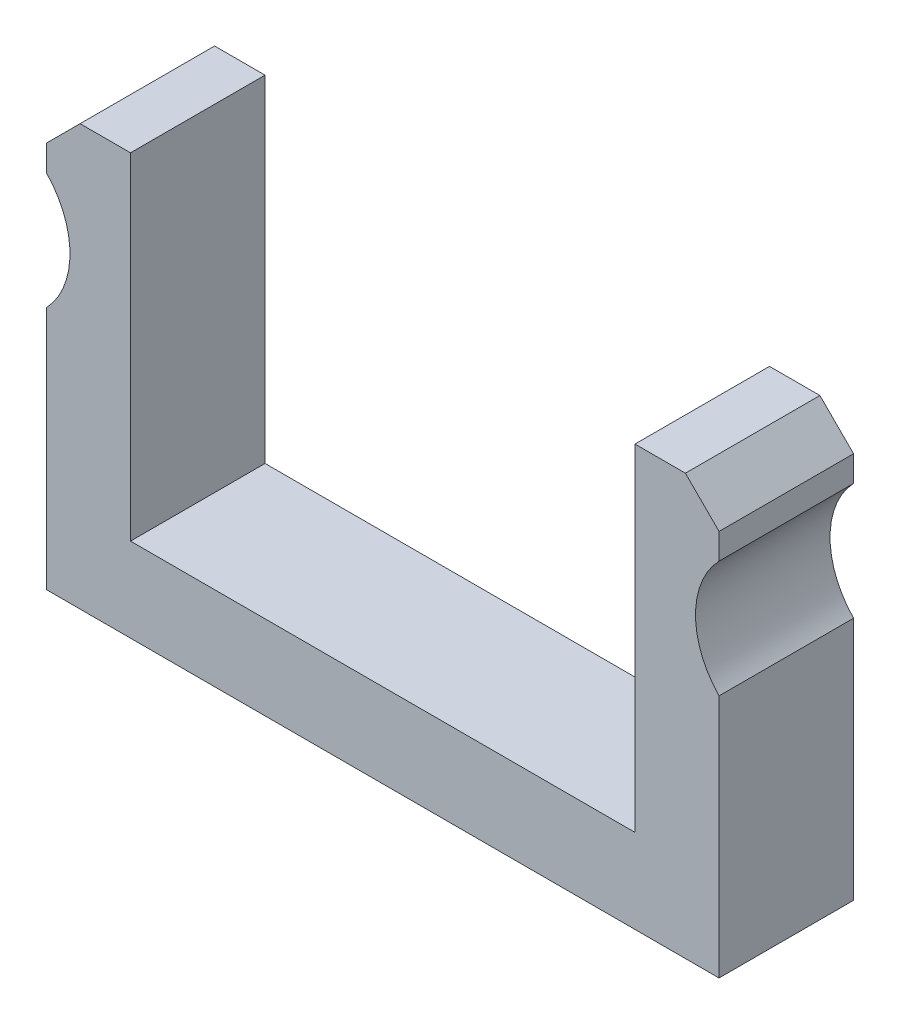
ISO-10303-21;
HEADER;
FILE_DESCRIPTION(('STEP AP214'),'2;1');
FILE_NAME('part.step','',(''),(''),'','','');
FILE_SCHEMA(('AUTOMOTIVE_DESIGN { 1 0 10303 214 1 1 1 1 }'));
ENDSEC;
DATA;
#1=APPLICATION_CONTEXT('core data for automotive mechanical design processes');
#2=APPLICATION_PROTOCOL_DEFINITION('international standard','automotive_design',2000,#1);
#3=PRODUCT_CONTEXT('',#1,'mechanical');
#4=PRODUCT('Part','Part','',(#3));
#5=PRODUCT_RELATED_PRODUCT_CATEGORY('part','',(#4));
#6=PRODUCT_DEFINITION_FORMATION('','',#4);
#7=PRODUCT_DEFINITION_CONTEXT('part definition',#1,'design');
#8=PRODUCT_DEFINITION('design','',#6,#7);
#9=PRODUCT_DEFINITION_SHAPE('','',#8);
#10=(LENGTH_UNIT() NAMED_UNIT(*) SI_UNIT(.MILLI.,.METRE.));
#11=(NAMED_UNIT(*) PLANE_ANGLE_UNIT() SI_UNIT($,.RADIAN.));
#12=(NAMED_UNIT(*) SI_UNIT($,.STERADIAN.) SOLID_ANGLE_UNIT());
#13=UNCERTAINTY_MEASURE_WITH_UNIT(LENGTH_MEASURE(1.E-05),#10,'distance_accuracy_value','');
#14=(GEOMETRIC_REPRESENTATION_CONTEXT(3) GLOBAL_UNCERTAINTY_ASSIGNED_CONTEXT((#13)) GLOBAL_UNIT_ASSIGNED_CONTEXT((#10,
#11,#12)) REPRESENTATION_CONTEXT('',''));
#15=CARTESIAN_POINT('',(0.,0.,0.));
#16=DIRECTION('',(0.,0.,1.));
#17=DIRECTION('',(1.,0.,0.));
#18=AXIS2_PLACEMENT_3D('',#15,#16,#17);
#19=CARTESIAN_POINT('',(16.7574956918045,-19.3746351202378,10.16));
#20=DIRECTION('',(-1.,0.,0.));
#21=DIRECTION('',(0.,0.,1.));
#22=AXIS2_PLACEMENT_3D('',#19,#20,#21);
#23=PLANE('',#22);
#24=DIRECTION('',(0.,1.,0.));
#25=VECTOR('',#24,1.);
#26=CARTESIAN_POINT('',(16.7574956918045,-19.3746351202378,0.));
#27=LINE('',#26,#25);
#28=CARTESIAN_POINT('',(16.7574956918045,-19.3746351202378,0.));
#29=VERTEX_POINT('',#28);
#30=CARTESIAN_POINT('',(16.7574956918045,-0.921370419753809,0.));
#31=VERTEX_POINT('',#30);
#32=EDGE_CURVE('E180',#29,#31,#27,.T.);
#33=ORIENTED_EDGE('',*,*,#32,.T.);
#34=DIRECTION('',(0.,0.,1.));
#35=VECTOR('',#34,1.);
#36=CARTESIAN_POINT('',(16.7574956918045,-0.921370419753809,-15.24));
#37=LINE('',#36,#35);
#38=CARTESIAN_POINT('',(16.7574956918045,-0.921370419753809,10.16));
#39=VERTEX_POINT('',#38);
#40=EDGE_CURVE('E143',#31,#39,#37,.T.);
#41=ORIENTED_EDGE('',*,*,#40,.T.);
#42=DIRECTION('',(0.,1.,0.));
#43=VECTOR('',#42,1.);
#44=CARTESIAN_POINT('',(16.7574956918045,-19.3746351202378,10.16));
#45=LINE('',#44,#43);
#46=CARTESIAN_POINT('',(16.7574956918045,-19.3746351202378,10.16));
#47=VERTEX_POINT('',#46);
#48=EDGE_CURVE('E152',#47,#39,#45,.T.);
#49=ORIENTED_EDGE('',*,*,#48,.F.);
#50=DIRECTION('',(0.,0.,-1.));
#51=VECTOR('',#50,1.);
#52=CARTESIAN_POINT('',(16.7574956918045,-19.3746351202378,10.16));
#53=LINE('',#52,#51);
#54=EDGE_CURVE('E205',#47,#29,#53,.T.);
#55=ORIENTED_EDGE('',*,*,#54,.T.);
#56=EDGE_LOOP('',(#33,#41,#49,#55));
#57=FACE_BOUND('',#56,.T.);
#58=ADVANCED_FACE('F32',(#57),#23,.F.);
#59=CARTESIAN_POINT('',(-34.0425043081955,-19.3746351202378,10.16));
#60=DIRECTION('',(1.,0.,0.));
#61=DIRECTION('',(0.,0.,-1.));
#62=AXIS2_PLACEMENT_3D('',#59,#60,#61);
#63=PLANE('',#62);
#64=DIRECTION('',(0.,-1.,0.));
#65=VECTOR('',#64,1.);
#66=CARTESIAN_POINT('',(-34.0425043081955,-19.3746351202378,10.16));
#67=LINE('',#66,#65);
#68=CARTESIAN_POINT('',(-34.0425043081955,9.83536487976214,10.16));
#69=VERTEX_POINT('',#68);
#70=CARTESIAN_POINT('',(-34.0425043081955,7.89210017927812,10.16));
#71=VERTEX_POINT('',#70);
#72=EDGE_CURVE('E160',#69,#71,#67,.T.);
#73=ORIENTED_EDGE('',*,*,#72,.F.);
#74=DIRECTION('',(0.,0.,-1.));
#75=VECTOR('',#74,1.);
#76=CARTESIAN_POINT('',(-34.0425043081955,9.83536487976214,10.16));
#77=LINE('',#76,#75);
#78=CARTESIAN_POINT('',(-34.0425043081955,9.83536487976214,0.));
#79=VERTEX_POINT('',#78);
#80=EDGE_CURVE('E222',#69,#79,#77,.T.);
#81=ORIENTED_EDGE('',*,*,#80,.T.);
#82=DIRECTION('',(0.,-1.,0.));
#83=VECTOR('',#82,1.);
#84=CARTESIAN_POINT('',(-34.0425043081955,-19.3746351202378,0.));
#85=LINE('',#84,#83);
#86=CARTESIAN_POINT('',(-34.0425043081955,7.89210017927812,0.));
#87=VERTEX_POINT('',#86);
#88=EDGE_CURVE('E174',#79,#87,#85,.T.);
#89=ORIENTED_EDGE('',*,*,#88,.T.);
#90=DIRECTION('',(0.,0.,1.));
#91=VECTOR('',#90,1.);
#92=CARTESIAN_POINT('',(-34.0425043081955,7.89210017927812,-15.24));
#93=LINE('',#92,#91);
#94=EDGE_CURVE('E243',#87,#71,#93,.T.);
#95=ORIENTED_EDGE('',*,*,#94,.T.);
#96=EDGE_LOOP('',(#73,#81,#89,#95));
#97=FACE_BOUND('',#96,.T.);
#98=ADVANCED_FACE('F228',(#97),#63,.F.);
#99=CARTESIAN_POINT('',(-34.0425043081955,-0.921370419753809,10.16));
#100=VERTEX_POINT('',#99);
#101=CARTESIAN_POINT('',(-34.0425043081955,-19.3746351202378,10.16));
#102=VERTEX_POINT('',#101);
#103=EDGE_CURVE('E193',#100,#102,#67,.T.);
#104=ORIENTED_EDGE('',*,*,#103,.F.);
#105=DIRECTION('',(0.,0.,1.));
#106=VECTOR('',#105,1.);
#107=CARTESIAN_POINT('',(-34.0425043081955,-0.921370419753809,-15.24));
#108=LINE('',#107,#106);
#109=CARTESIAN_POINT('',(-34.0425043081955,-0.921370419753809,0.));
#110=VERTEX_POINT('',#109);
#111=EDGE_CURVE('E241',#100,#110,#108,.F.);
#112=ORIENTED_EDGE('',*,*,#111,.T.);
#113=CARTESIAN_POINT('',(-34.0425043081955,-19.3746351202378,0.));
#114=VERTEX_POINT('',#113);
#115=EDGE_CURVE('E177',#110,#114,#85,.T.);
#116=ORIENTED_EDGE('',*,*,#115,.T.);
#117=DIRECTION('',(0.,0.,-1.));
#118=VECTOR('',#117,1.);
#119=CARTESIAN_POINT('',(-34.0425043081955,-19.3746351202378,10.16));
#120=LINE('',#119,#118);
#121=EDGE_CURVE('E208',#102,#114,#120,.T.);
#122=ORIENTED_EDGE('',*,*,#121,.F.);
#123=EDGE_LOOP('',(#104,#112,#116,#122));
#124=FACE_BOUND('',#123,.T.);
#125=ADVANCED_FACE('F246',(#124),#63,.F.);
#126=CARTESIAN_POINT('',(-34.0425043081955,-19.3746351202378,10.16));
#127=DIRECTION('',(0.,1.,0.));
#128=DIRECTION('',(0.,0.,1.));
#129=AXIS2_PLACEMENT_3D('',#126,#127,#128);
#130=PLANE('',#129);
#131=DIRECTION('',(1.,0.,0.));
#132=VECTOR('',#131,1.);
#133=CARTESIAN_POINT('',(-34.0425043081955,-19.3746351202378,0.));
#134=LINE('',#133,#132);
#135=EDGE_CURVE('E176',#114,#29,#134,.T.);
#136=ORIENTED_EDGE('',*,*,#135,.T.);
#137=ORIENTED_EDGE('',*,*,#54,.F.);
#138=DIRECTION('',(1.,0.,0.));
#139=VECTOR('',#138,1.);
#140=CARTESIAN_POINT('',(-34.0425043081955,-19.3746351202378,10.16));
#141=LINE('',#140,#139);
#142=EDGE_CURVE('E157',#102,#47,#141,.T.);
#143=ORIENTED_EDGE('',*,*,#142,.F.);
#144=ORIENTED_EDGE('',*,*,#121,.T.);
#145=EDGE_LOOP('',(#136,#137,#143,#144));
#146=FACE_BOUND('',#145,.T.);
#147=ADVANCED_FACE('F256',(#146),#130,.F.);
#148=CARTESIAN_POINT('',(16.7574956918045,7.89210017927812,0.));
#149=VERTEX_POINT('',#148);
#150=CARTESIAN_POINT('',(16.7574956918045,9.83536487976212,0.));
#151=VERTEX_POINT('',#150);
#152=EDGE_CURVE('E179',#149,#151,#27,.T.);
#153=ORIENTED_EDGE('',*,*,#152,.T.);
#154=DIRECTION('',(0.,0.,1.));
#155=VECTOR('',#154,1.);
#156=CARTESIAN_POINT('',(16.7574956918045,9.83536487976212,10.16));
#157=LINE('',#156,#155);
#158=CARTESIAN_POINT('',(16.7574956918045,9.83536487976213,10.16));
#159=VERTEX_POINT('',#158);
#160=EDGE_CURVE('E156',#151,#159,#157,.T.);
#161=ORIENTED_EDGE('',*,*,#160,.T.);
#162=CARTESIAN_POINT('',(16.7574956918045,7.89210017927812,10.16));
#163=VERTEX_POINT('',#162);
#164=EDGE_CURVE('E149',#163,#159,#45,.T.);
#165=ORIENTED_EDGE('',*,*,#164,.F.);
#166=DIRECTION('',(0.,0.,1.));
#167=VECTOR('',#166,1.);
#168=CARTESIAN_POINT('',(16.7574956918045,7.89210017927812,-15.24));
#169=LINE('',#168,#167);
#170=EDGE_CURVE('E132',#163,#149,#169,.F.);
#171=ORIENTED_EDGE('',*,*,#170,.T.);
#172=EDGE_LOOP('',(#153,#161,#165,#171));
#173=FACE_BOUND('',#172,.T.);
#174=ADVANCED_FACE('F154',(#173),#23,.F.);
#175=CARTESIAN_POINT('',(16.7574956918045,12.3753648797622,10.16));
#176=DIRECTION('',(0.,-1.,0.));
#177=DIRECTION('',(0.,0.,-1.));
#178=AXIS2_PLACEMENT_3D('',#175,#176,#177);
#179=PLANE('',#178);
#180=DIRECTION('',(-1.,0.,0.));
#181=VECTOR('',#180,1.);
#182=CARTESIAN_POINT('',(16.7574956918045,12.3753648797622,10.16));
#183=LINE('',#182,#181);
#184=CARTESIAN_POINT('',(14.2174956918045,12.3753648797622,10.16));
#185=VERTEX_POINT('',#184);
#186=CARTESIAN_POINT('',(10.4074956918045,12.3753648797622,10.16));
#187=VERTEX_POINT('',#186);
#188=EDGE_CURVE('E159',#185,#187,#183,.T.);
#189=ORIENTED_EDGE('',*,*,#188,.F.);
#190=DIRECTION('',(0.,0.,-1.));
#191=VECTOR('',#190,1.);
#192=CARTESIAN_POINT('',(14.2174956918045,12.3753648797622,10.16));
#193=LINE('',#192,#191);
#194=CARTESIAN_POINT('',(14.2174956918045,12.3753648797622,0.));
#195=VERTEX_POINT('',#194);
#196=EDGE_CURVE('E214',#185,#195,#193,.T.);
#197=ORIENTED_EDGE('',*,*,#196,.T.);
#198=DIRECTION('',(-1.,0.,0.));
#199=VECTOR('',#198,1.);
#200=CARTESIAN_POINT('',(16.7574956918045,12.3753648797622,0.));
#201=LINE('',#200,#199);
#202=CARTESIAN_POINT('',(10.4074956918045,12.3753648797622,0.));
#203=VERTEX_POINT('',#202);
#204=EDGE_CURVE('E183',#195,#203,#201,.T.);
#205=ORIENTED_EDGE('',*,*,#204,.T.);
#206=DIRECTION('',(0.,0.,-1.));
#207=VECTOR('',#206,1.);
#208=CARTESIAN_POINT('',(10.4074956918045,12.3753648797622,10.16));
#209=LINE('',#208,#207);
#210=EDGE_CURVE('E202',#187,#203,#209,.T.);
#211=ORIENTED_EDGE('',*,*,#210,.F.);
#212=EDGE_LOOP('',(#189,#197,#205,#211));
#213=FACE_BOUND('',#212,.T.);
#214=ADVANCED_FACE('F266',(#213),#179,.F.);
#215=CARTESIAN_POINT('',(10.4074956918045,12.3753648797622,10.16));
#216=DIRECTION('',(1.,0.,0.));
#217=DIRECTION('',(0.,1.,0.));
#218=AXIS2_PLACEMENT_3D('',#215,#216,#217);
#219=PLANE('',#218);
#220=DIRECTION('',(0.,-1.,0.));
#221=VECTOR('',#220,1.);
#222=CARTESIAN_POINT('',(10.4074956918045,12.3753648797622,0.));
#223=LINE('',#222,#221);
#224=CARTESIAN_POINT('',(10.4074956918045,-13.0246351202378,0.));
#225=VERTEX_POINT('',#224);
#226=EDGE_CURVE('E185',#203,#225,#223,.T.);
#227=ORIENTED_EDGE('',*,*,#226,.T.);
#228=DIRECTION('',(0.,0.,-1.));
#229=VECTOR('',#228,1.);
#230=CARTESIAN_POINT('',(10.4074956918045,-13.0246351202378,10.16));
#231=LINE('',#230,#229);
#232=CARTESIAN_POINT('',(10.4074956918045,-13.0246351202378,10.16));
#233=VERTEX_POINT('',#232);
#234=EDGE_CURVE('E199',#233,#225,#231,.T.);
#235=ORIENTED_EDGE('',*,*,#234,.F.);
#236=DIRECTION('',(0.,-1.,0.));
#237=VECTOR('',#236,1.);
#238=CARTESIAN_POINT('',(10.4074956918045,12.3753648797622,10.16));
#239=LINE('',#238,#237);
#240=EDGE_CURVE('E165',#187,#233,#239,.T.);
#241=ORIENTED_EDGE('',*,*,#240,.F.);
#242=ORIENTED_EDGE('',*,*,#210,.T.);
#243=EDGE_LOOP('',(#227,#235,#241,#242));
#244=FACE_BOUND('',#243,.T.);
#245=ADVANCED_FACE('F271',(#244),#219,.F.);
#246=CARTESIAN_POINT('',(10.4074956918045,-13.0246351202378,10.16));
#247=DIRECTION('',(0.,-1.,0.));
#248=DIRECTION('',(1.,0.,0.));
#249=AXIS2_PLACEMENT_3D('',#246,#247,#248);
#250=PLANE('',#249);
#251=DIRECTION('',(-1.,0.,0.));
#252=VECTOR('',#251,1.);
#253=CARTESIAN_POINT('',(10.4074956918045,-13.0246351202378,0.));
#254=LINE('',#253,#252);
#255=CARTESIAN_POINT('',(-27.6925043081955,-13.0246351202379,0.));
#256=VERTEX_POINT('',#255);
#257=EDGE_CURVE('E187',#225,#256,#254,.T.);
#258=ORIENTED_EDGE('',*,*,#257,.T.);
#259=DIRECTION('',(0.,0.,-1.));
#260=VECTOR('',#259,1.);
#261=CARTESIAN_POINT('',(-27.6925043081955,-13.0246351202379,10.16));
#262=LINE('',#261,#260);
#263=CARTESIAN_POINT('',(-27.6925043081955,-13.0246351202379,10.16));
#264=VERTEX_POINT('',#263);
#265=EDGE_CURVE('E196',#264,#256,#262,.T.);
#266=ORIENTED_EDGE('',*,*,#265,.F.);
#267=DIRECTION('',(-1.,0.,0.));
#268=VECTOR('',#267,1.);
#269=CARTESIAN_POINT('',(10.4074956918045,-13.0246351202378,10.16));
#270=LINE('',#269,#268);
#271=EDGE_CURVE('E167',#233,#264,#270,.T.);
#272=ORIENTED_EDGE('',*,*,#271,.F.);
#273=ORIENTED_EDGE('',*,*,#234,.T.);
#274=EDGE_LOOP('',(#258,#266,#272,#273));
#275=FACE_BOUND('',#274,.T.);
#276=ADVANCED_FACE('F277',(#275),#250,.F.);
#277=CARTESIAN_POINT('',(-27.6925043081955,-13.0246351202379,10.16));
#278=DIRECTION('',(-1.,0.,0.));
#279=DIRECTION('',(0.,0.,1.));
#280=AXIS2_PLACEMENT_3D('',#277,#278,#279);
#281=PLANE('',#280);
#282=DIRECTION('',(0.,1.,0.));
#283=VECTOR('',#282,1.);
#284=CARTESIAN_POINT('',(-27.6925043081955,-13.0246351202379,0.));
#285=LINE('',#284,#283);
#286=CARTESIAN_POINT('',(-27.6925043081955,12.3753648797622,0.));
#287=VERTEX_POINT('',#286);
#288=EDGE_CURVE('E189',#256,#287,#285,.T.);
#289=ORIENTED_EDGE('',*,*,#288,.T.);
#290=DIRECTION('',(0.,0.,-1.));
#291=VECTOR('',#290,1.);
#292=CARTESIAN_POINT('',(-27.6925043081955,12.3753648797622,10.16));
#293=LINE('',#292,#291);
#294=CARTESIAN_POINT('',(-27.6925043081955,12.3753648797622,10.16));
#295=VERTEX_POINT('',#294);
#296=EDGE_CURVE('E173',#295,#287,#293,.T.);
#297=ORIENTED_EDGE('',*,*,#296,.F.);
#298=DIRECTION('',(0.,1.,0.));
#299=VECTOR('',#298,1.);
#300=CARTESIAN_POINT('',(-27.6925043081955,-13.0246351202379,10.16));
#301=LINE('',#300,#299);
#302=EDGE_CURVE('E169',#264,#295,#301,.T.);
#303=ORIENTED_EDGE('',*,*,#302,.F.);
#304=ORIENTED_EDGE('',*,*,#265,.T.);
#305=EDGE_LOOP('',(#289,#297,#303,#304));
#306=FACE_BOUND('',#305,.T.);
#307=ADVANCED_FACE('F281',(#306),#281,.F.);
#308=CARTESIAN_POINT('',(-34.0425043081955,12.3753648797622,10.16));
#309=DIRECTION('',(0.,-1.,0.));
#310=DIRECTION('',(0.,0.,-1.));
#311=AXIS2_PLACEMENT_3D('',#308,#309,#310);
#312=PLANE('',#311);
#313=DIRECTION('',(-1.,0.,0.));
#314=VECTOR('',#313,1.);
#315=CARTESIAN_POINT('',(-34.0425043081955,12.3753648797622,0.));
#316=LINE('',#315,#314);
#317=CARTESIAN_POINT('',(-31.5025043081955,12.3753648797622,0.));
#318=VERTEX_POINT('',#317);
#319=EDGE_CURVE('E191',#287,#318,#316,.T.);
#320=ORIENTED_EDGE('',*,*,#319,.T.);
#321=DIRECTION('',(0.,0.,1.));
#322=VECTOR('',#321,1.);
#323=CARTESIAN_POINT('',(-31.5025043081955,12.3753648797622,10.16));
#324=LINE('',#323,#322);
#325=CARTESIAN_POINT('',(-31.5025043081955,12.3753648797622,10.16));
#326=VERTEX_POINT('',#325);
#327=EDGE_CURVE('E40',#318,#326,#324,.T.);
#328=ORIENTED_EDGE('',*,*,#327,.T.);
#329=DIRECTION('',(-1.,0.,0.));
#330=VECTOR('',#329,1.);
#331=CARTESIAN_POINT('',(-34.0425043081955,12.3753648797622,10.16));
#332=LINE('',#331,#330);
#333=EDGE_CURVE('E171',#295,#326,#332,.T.);
#334=ORIENTED_EDGE('',*,*,#333,.F.);
#335=ORIENTED_EDGE('',*,*,#296,.T.);
#336=EDGE_LOOP('',(#320,#328,#334,#335));
#337=FACE_BOUND('',#336,.T.);
#338=ADVANCED_FACE('F282',(#337),#312,.F.);
#339=CARTESIAN_POINT('',(-34.0425043081955,12.3753648797622,10.16));
#340=DIRECTION('',(0.,0.,-1.));
#341=DIRECTION('',(-1.,0.,0.));
#342=AXIS2_PLACEMENT_3D('',#339,#340,#341);
#343=PLANE('',#342);
#344=ORIENTED_EDGE('',*,*,#333,.T.);
#345=DIRECTION('',(0.707106781186549,0.707106781186547,0.));
#346=VECTOR('',#345,1.);
#347=CARTESIAN_POINT('',(-34.0425043081955,9.83536487976214,10.16));
#348=LINE('',#347,#346);
#349=EDGE_CURVE('E11',#326,#69,#348,.F.);
#350=ORIENTED_EDGE('',*,*,#349,.T.);
#351=ORIENTED_EDGE('',*,*,#72,.T.);
#352=CARTESIAN_POINT('',(-38.6145043081955,3.48536487976215,10.16));
#353=DIRECTION('',(0.,0.,1.));
#354=DIRECTION('',(1.,0.,0.));
#355=AXIS2_PLACEMENT_3D('',#352,#353,#354);
#356=CIRCLE('',#355,6.35);
#357=EDGE_CURVE('E248',#100,#71,#356,.T.);
#358=ORIENTED_EDGE('',*,*,#357,.F.);
#359=ORIENTED_EDGE('',*,*,#103,.T.);
#360=ORIENTED_EDGE('',*,*,#142,.T.);
#361=ORIENTED_EDGE('',*,*,#48,.T.);
#362=CARTESIAN_POINT('',(21.3294956918045,3.48536487976215,10.16));
#363=DIRECTION('',(0.,0.,1.));
#364=DIRECTION('',(1.,0.,0.));
#365=AXIS2_PLACEMENT_3D('',#362,#363,#364);
#366=CIRCLE('',#365,6.35);
#367=EDGE_CURVE('E135',#163,#39,#366,.T.);
#368=ORIENTED_EDGE('',*,*,#367,.F.);
#369=ORIENTED_EDGE('',*,*,#164,.T.);
#370=DIRECTION('',(0.707106781186546,-0.707106781186549,0.));
#371=VECTOR('',#370,1.);
#372=CARTESIAN_POINT('',(14.2174956918045,12.3753648797622,10.16));
#373=LINE('',#372,#371);
#374=EDGE_CURVE('E220',#159,#185,#373,.F.);
#375=ORIENTED_EDGE('',*,*,#374,.T.);
#376=ORIENTED_EDGE('',*,*,#188,.T.);
#377=ORIENTED_EDGE('',*,*,#240,.T.);
#378=ORIENTED_EDGE('',*,*,#271,.T.);
#379=ORIENTED_EDGE('',*,*,#302,.T.);
#380=EDGE_LOOP('',(#344,#350,#351,#358,#359,#360,#361,#368,#369,#375,#376,#377,#378,#379));
#381=FACE_BOUND('',#380,.T.);
#382=ADVANCED_FACE('F148',(#381),#343,.F.);
#383=CARTESIAN_POINT('',(-34.0425043081955,12.3753648797622,0.));
#384=DIRECTION('',(0.,0.,-1.));
#385=DIRECTION('',(-1.,0.,0.));
#386=AXIS2_PLACEMENT_3D('',#383,#384,#385);
#387=PLANE('',#386);
#388=ORIENTED_EDGE('',*,*,#88,.F.);
#389=DIRECTION('',(-0.707106781186549,-0.707106781186547,0.));
#390=VECTOR('',#389,1.);
#391=CARTESIAN_POINT('',(-32.7725043081955,11.1053648797621,0.));
#392=LINE('',#391,#390);
#393=EDGE_CURVE('E54',#79,#318,#392,.F.);
#394=ORIENTED_EDGE('',*,*,#393,.T.);
#395=ORIENTED_EDGE('',*,*,#319,.F.);
#396=ORIENTED_EDGE('',*,*,#288,.F.);
#397=ORIENTED_EDGE('',*,*,#257,.F.);
#398=ORIENTED_EDGE('',*,*,#226,.F.);
#399=ORIENTED_EDGE('',*,*,#204,.F.);
#400=DIRECTION('',(-0.707106781186546,0.707106781186549,0.));
#401=VECTOR('',#400,1.);
#402=CARTESIAN_POINT('',(-9.9125043081954,36.5053648797621,0.));
#403=LINE('',#402,#401);
#404=EDGE_CURVE('E217',#195,#151,#403,.F.);
#405=ORIENTED_EDGE('',*,*,#404,.T.);
#406=ORIENTED_EDGE('',*,*,#152,.F.);
#407=CARTESIAN_POINT('',(21.3294956918045,3.48536487976215,0.));
#408=DIRECTION('',(0.,0.,-1.));
#409=DIRECTION('',(-1.,0.,0.));
#410=AXIS2_PLACEMENT_3D('',#407,#408,#409);
#411=CIRCLE('',#410,6.35);
#412=EDGE_CURVE('E138',#31,#149,#411,.T.);
#413=ORIENTED_EDGE('',*,*,#412,.F.);
#414=ORIENTED_EDGE('',*,*,#32,.F.);
#415=ORIENTED_EDGE('',*,*,#135,.F.);
#416=ORIENTED_EDGE('',*,*,#115,.F.);
#417=CARTESIAN_POINT('',(-38.6145043081955,3.48536487976215,0.));
#418=DIRECTION('',(0.,0.,-1.));
#419=DIRECTION('',(-1.,0.,0.));
#420=AXIS2_PLACEMENT_3D('',#417,#418,#419);
#421=CIRCLE('',#420,6.35);
#422=EDGE_CURVE('E211',#87,#110,#421,.T.);
#423=ORIENTED_EDGE('',*,*,#422,.F.);
#424=EDGE_LOOP('',(#388,#394,#395,#396,#397,#398,#399,#405,#406,#413,#414,#415,#416,#423));
#425=FACE_BOUND('',#424,.T.);
#426=ADVANCED_FACE('F234',(#425),#387,.T.);
#427=CARTESIAN_POINT('',(-38.6145043081955,3.48536487976215,-15.24));
#428=DIRECTION('',(0.,0.,1.));
#429=DIRECTION('',(1.,0.,0.));
#430=AXIS2_PLACEMENT_3D('',#427,#428,#429);
#431=CYLINDRICAL_SURFACE('',#430,6.35);
#432=ORIENTED_EDGE('',*,*,#422,.T.);
#433=ORIENTED_EDGE('',*,*,#111,.F.);
#434=ORIENTED_EDGE('',*,*,#357,.T.);
#435=ORIENTED_EDGE('',*,*,#94,.F.);
#436=EDGE_LOOP('',(#432,#433,#434,#435));
#437=FACE_BOUND('',#436,.T.);
#438=ADVANCED_FACE('F239',(#437),#431,.F.);
#439=CARTESIAN_POINT('',(21.3294956918045,3.48536487976215,-15.24));
#440=DIRECTION('',(0.,0.,1.));
#441=DIRECTION('',(1.,0.,0.));
#442=AXIS2_PLACEMENT_3D('',#439,#440,#441);
#443=CYLINDRICAL_SURFACE('',#442,6.35);
#444=ORIENTED_EDGE('',*,*,#412,.T.);
#445=ORIENTED_EDGE('',*,*,#170,.F.);
#446=ORIENTED_EDGE('',*,*,#367,.T.);
#447=ORIENTED_EDGE('',*,*,#40,.F.);
#448=EDGE_LOOP('',(#444,#445,#446,#447));
#449=FACE_BOUND('',#448,.T.);
#450=ADVANCED_FACE('F134',(#449),#443,.F.);
#451=CARTESIAN_POINT('',(14.2174956918045,12.3753648797622,10.16));
#452=DIRECTION('',(-0.707106781186549,-0.707106781186545,0.));
#453=DIRECTION('',(0.707106781186546,-0.707106781186549,0.));
#454=AXIS2_PLACEMENT_3D('',#451,#452,#453);
#455=PLANE('',#454);
#456=ORIENTED_EDGE('',*,*,#374,.F.);
#457=ORIENTED_EDGE('',*,*,#160,.F.);
#458=ORIENTED_EDGE('',*,*,#404,.F.);
#459=ORIENTED_EDGE('',*,*,#196,.F.);
#460=EDGE_LOOP('',(#456,#457,#458,#459));
#461=FACE_BOUND('',#460,.T.);
#462=ADVANCED_FACE('F261',(#461),#455,.F.);
#463=CARTESIAN_POINT('',(-34.0425043081955,9.83536487976214,10.16));
#464=DIRECTION('',(0.707106781186547,-0.707106781186549,0.));
#465=DIRECTION('',(0.707106781186549,0.707106781186547,0.));
#466=AXIS2_PLACEMENT_3D('',#463,#464,#465);
#467=PLANE('',#466);
#468=ORIENTED_EDGE('',*,*,#349,.F.);
#469=ORIENTED_EDGE('',*,*,#327,.F.);
#470=ORIENTED_EDGE('',*,*,#393,.F.);
#471=ORIENTED_EDGE('',*,*,#80,.F.);
#472=EDGE_LOOP('',(#468,#469,#470,#471));
#473=FACE_BOUND('',#472,.T.);
#474=ADVANCED_FACE('F34',(#473),#467,.F.);
#475=CLOSED_SHELL('',(#58,#98,#125,#147,#174,#214,#245,#276,#307,#338,#382,#426,#438,#450,#462,#474));
#476=MANIFOLD_SOLID_BREP('B2',#475);
#477=ADVANCED_BREP_SHAPE_REPRESENTATION('',(#18,#476),#14);
#478=SHAPE_DEFINITION_REPRESENTATION(#9,#477);
ENDSEC;
END-ISO-10303-21;
